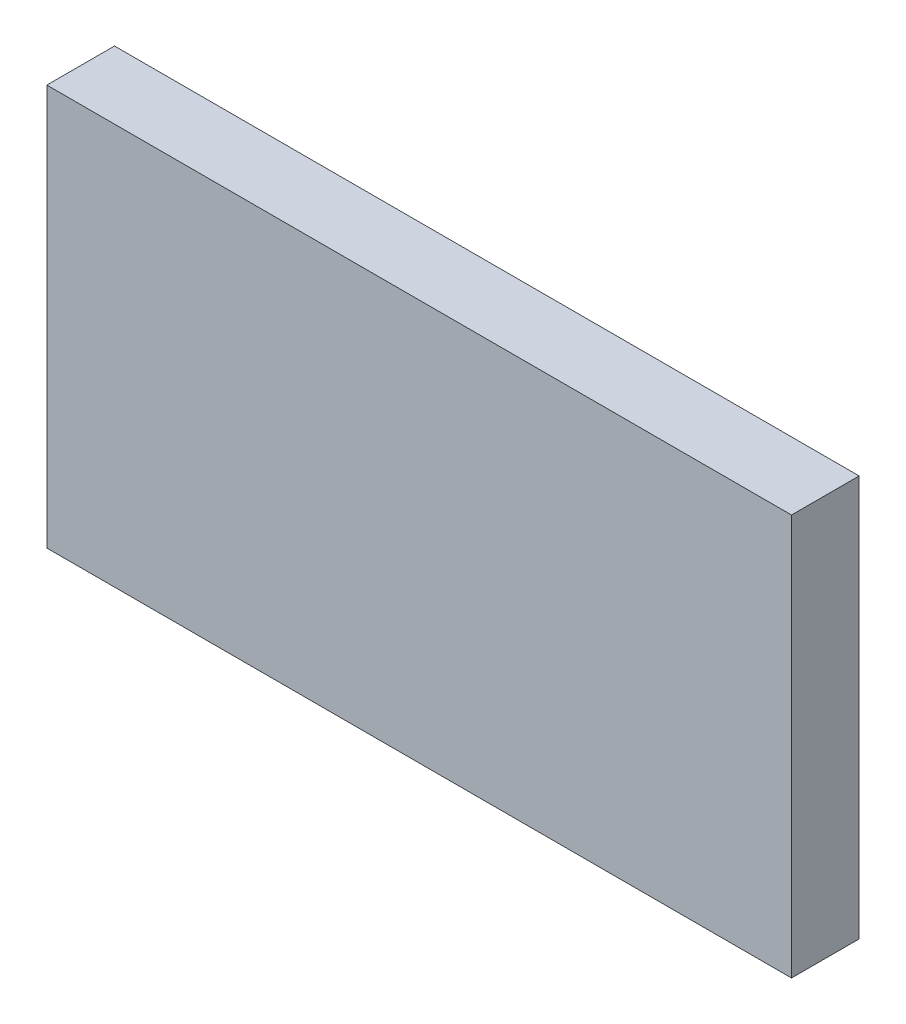
ISO-10303-21;
HEADER;
FILE_DESCRIPTION(('STEP AP214'),'2;1');
FILE_NAME('part.step','',(''),(''),'','','');
FILE_SCHEMA(('AUTOMOTIVE_DESIGN { 1 0 10303 214 1 1 1 1 }'));
ENDSEC;
DATA;
#1=APPLICATION_CONTEXT('core data for automotive mechanical design processes');
#2=APPLICATION_PROTOCOL_DEFINITION('international standard','automotive_design',2000,#1);
#3=PRODUCT_CONTEXT('',#1,'mechanical');
#4=PRODUCT('Part','Part','',(#3));
#5=PRODUCT_RELATED_PRODUCT_CATEGORY('part','',(#4));
#6=PRODUCT_DEFINITION_FORMATION('','',#4);
#7=PRODUCT_DEFINITION_CONTEXT('part definition',#1,'design');
#8=PRODUCT_DEFINITION('design','',#6,#7);
#9=PRODUCT_DEFINITION_SHAPE('','',#8);
#10=(LENGTH_UNIT() NAMED_UNIT(*) SI_UNIT(.MILLI.,.METRE.));
#11=(NAMED_UNIT(*) PLANE_ANGLE_UNIT() SI_UNIT($,.RADIAN.));
#12=(NAMED_UNIT(*) SI_UNIT($,.STERADIAN.) SOLID_ANGLE_UNIT());
#13=UNCERTAINTY_MEASURE_WITH_UNIT(LENGTH_MEASURE(1.E-05),#10,'distance_accuracy_value','');
#14=(GEOMETRIC_REPRESENTATION_CONTEXT(3) GLOBAL_UNCERTAINTY_ASSIGNED_CONTEXT((#13)) GLOBAL_UNIT_ASSIGNED_CONTEXT((#10,
#11,#12)) REPRESENTATION_CONTEXT('',''));
#15=CARTESIAN_POINT('',(0.,0.,0.));
#16=DIRECTION('',(0.,0.,1.));
#17=DIRECTION('',(1.,0.,0.));
#18=AXIS2_PLACEMENT_3D('',#15,#16,#17);
#19=CARTESIAN_POINT('',(-33.02,17.78,3.));
#20=DIRECTION('',(1.,0.,0.));
#21=DIRECTION('',(0.,0.,-1.));
#22=AXIS2_PLACEMENT_3D('',#19,#20,#21);
#23=PLANE('',#22);
#24=DIRECTION('',(0.,-1.,0.));
#25=VECTOR('',#24,1.);
#26=CARTESIAN_POINT('',(-33.02,17.78,0.));
#27=LINE('',#26,#25);
#28=CARTESIAN_POINT('',(-33.02,17.78,0.));
#29=VERTEX_POINT('',#28);
#30=CARTESIAN_POINT('',(-33.02,0.,0.));
#31=VERTEX_POINT('',#30);
#32=EDGE_CURVE('E96',#29,#31,#27,.T.);
#33=ORIENTED_EDGE('',*,*,#32,.T.);
#34=DIRECTION('',(0.,0.,-1.));
#35=VECTOR('',#34,1.);
#36=CARTESIAN_POINT('',(-33.02,0.,3.));
#37=LINE('',#36,#35);
#38=CARTESIAN_POINT('',(-33.02,0.,3.));
#39=VERTEX_POINT('',#38);
#40=EDGE_CURVE('E11',#39,#31,#37,.T.);
#41=ORIENTED_EDGE('',*,*,#40,.F.);
#42=DIRECTION('',(0.,-1.,0.));
#43=VECTOR('',#42,1.);
#44=CARTESIAN_POINT('',(-33.02,17.78,3.));
#45=LINE('',#44,#43);
#46=CARTESIAN_POINT('',(-33.02,17.78,3.));
#47=VERTEX_POINT('',#46);
#48=EDGE_CURVE('E84',#47,#39,#45,.T.);
#49=ORIENTED_EDGE('',*,*,#48,.F.);
#50=DIRECTION('',(0.,0.,-1.));
#51=VECTOR('',#50,1.);
#52=CARTESIAN_POINT('',(-33.02,17.78,3.));
#53=LINE('',#52,#51);
#54=EDGE_CURVE('E92',#47,#29,#53,.T.);
#55=ORIENTED_EDGE('',*,*,#54,.T.);
#56=EDGE_LOOP('',(#33,#41,#49,#55));
#57=FACE_BOUND('',#56,.T.);
#58=ADVANCED_FACE('F33',(#57),#23,.F.);
#59=CARTESIAN_POINT('',(-33.02,0.,3.));
#60=DIRECTION('',(0.,1.,0.));
#61=DIRECTION('',(0.,0.,1.));
#62=AXIS2_PLACEMENT_3D('',#59,#60,#61);
#63=PLANE('',#62);
#64=DIRECTION('',(1.,0.,0.));
#65=VECTOR('',#64,1.);
#66=CARTESIAN_POINT('',(-33.02,0.,0.));
#67=LINE('',#66,#65);
#68=CARTESIAN_POINT('',(0.,0.,0.));
#69=VERTEX_POINT('',#68);
#70=EDGE_CURVE('E88',#31,#69,#67,.T.);
#71=ORIENTED_EDGE('',*,*,#70,.T.);
#72=DIRECTION('',(0.,0.,-1.));
#73=VECTOR('',#72,1.);
#74=CARTESIAN_POINT('',(0.,0.,3.));
#75=LINE('',#74,#73);
#76=CARTESIAN_POINT('',(0.,0.,3.));
#77=VERTEX_POINT('',#76);
#78=EDGE_CURVE('E41',#77,#69,#75,.T.);
#79=ORIENTED_EDGE('',*,*,#78,.F.);
#80=DIRECTION('',(1.,0.,0.));
#81=VECTOR('',#80,1.);
#82=CARTESIAN_POINT('',(-33.02,0.,3.));
#83=LINE('',#82,#81);
#84=EDGE_CURVE('E79',#39,#77,#83,.T.);
#85=ORIENTED_EDGE('',*,*,#84,.F.);
#86=ORIENTED_EDGE('',*,*,#40,.T.);
#87=EDGE_LOOP('',(#71,#79,#85,#86));
#88=FACE_BOUND('',#87,.T.);
#89=ADVANCED_FACE('F87',(#88),#63,.F.);
#90=CARTESIAN_POINT('',(0.,17.78,3.));
#91=DIRECTION('',(-1.,0.,0.));
#92=DIRECTION('',(0.,0.,1.));
#93=AXIS2_PLACEMENT_3D('',#90,#91,#92);
#94=PLANE('',#93);
#95=DIRECTION('',(0.,1.,0.));
#96=VECTOR('',#95,1.);
#97=CARTESIAN_POINT('',(0.,17.78,0.));
#98=LINE('',#97,#96);
#99=CARTESIAN_POINT('',(0.,17.78,0.));
#100=VERTEX_POINT('',#99);
#101=EDGE_CURVE('E66',#69,#100,#98,.T.);
#102=ORIENTED_EDGE('',*,*,#101,.T.);
#103=DIRECTION('',(0.,0.,-1.));
#104=VECTOR('',#103,1.);
#105=CARTESIAN_POINT('',(0.,17.78,3.));
#106=LINE('',#105,#104);
#107=CARTESIAN_POINT('',(0.,17.78,3.));
#108=VERTEX_POINT('',#107);
#109=EDGE_CURVE('E89',#108,#100,#106,.T.);
#110=ORIENTED_EDGE('',*,*,#109,.F.);
#111=DIRECTION('',(0.,1.,0.));
#112=VECTOR('',#111,1.);
#113=CARTESIAN_POINT('',(0.,17.78,3.));
#114=LINE('',#113,#112);
#115=EDGE_CURVE('E82',#77,#108,#114,.T.);
#116=ORIENTED_EDGE('',*,*,#115,.F.);
#117=ORIENTED_EDGE('',*,*,#78,.T.);
#118=EDGE_LOOP('',(#102,#110,#116,#117));
#119=FACE_BOUND('',#118,.T.);
#120=ADVANCED_FACE('F90',(#119),#94,.F.);
#121=CARTESIAN_POINT('',(-33.02,17.78,3.));
#122=DIRECTION('',(0.,-1.,0.));
#123=DIRECTION('',(0.,0.,-1.));
#124=AXIS2_PLACEMENT_3D('',#121,#122,#123);
#125=PLANE('',#124);
#126=DIRECTION('',(-1.,0.,0.));
#127=VECTOR('',#126,1.);
#128=CARTESIAN_POINT('',(-33.02,17.78,0.));
#129=LINE('',#128,#127);
#130=EDGE_CURVE('E72',#100,#29,#129,.T.);
#131=ORIENTED_EDGE('',*,*,#130,.T.);
#132=ORIENTED_EDGE('',*,*,#54,.F.);
#133=DIRECTION('',(-1.,0.,0.));
#134=VECTOR('',#133,1.);
#135=CARTESIAN_POINT('',(-33.02,17.78,3.));
#136=LINE('',#135,#134);
#137=EDGE_CURVE('E49',#108,#47,#136,.T.);
#138=ORIENTED_EDGE('',*,*,#137,.F.);
#139=ORIENTED_EDGE('',*,*,#109,.T.);
#140=EDGE_LOOP('',(#131,#132,#138,#139));
#141=FACE_BOUND('',#140,.T.);
#142=ADVANCED_FACE('F103',(#141),#125,.F.);
#143=CARTESIAN_POINT('',(0.,0.,3.));
#144=DIRECTION('',(0.,0.,1.));
#145=DIRECTION('',(1.,0.,0.));
#146=AXIS2_PLACEMENT_3D('',#143,#144,#145);
#147=PLANE('',#146);
#148=ORIENTED_EDGE('',*,*,#48,.T.);
#149=ORIENTED_EDGE('',*,*,#84,.T.);
#150=ORIENTED_EDGE('',*,*,#115,.T.);
#151=ORIENTED_EDGE('',*,*,#137,.T.);
#152=EDGE_LOOP('',(#148,#149,#150,#151));
#153=FACE_BOUND('',#152,.T.);
#154=ADVANCED_FACE('F80',(#153),#147,.T.);
#155=CARTESIAN_POINT('',(0.,0.,0.));
#156=DIRECTION('',(0.,0.,1.));
#157=DIRECTION('',(1.,0.,0.));
#158=AXIS2_PLACEMENT_3D('',#155,#156,#157);
#159=PLANE('',#158);
#160=ORIENTED_EDGE('',*,*,#32,.F.);
#161=ORIENTED_EDGE('',*,*,#130,.F.);
#162=ORIENTED_EDGE('',*,*,#101,.F.);
#163=ORIENTED_EDGE('',*,*,#70,.F.);
#164=EDGE_LOOP('',(#160,#161,#162,#163));
#165=FACE_BOUND('',#164,.T.);
#166=ADVANCED_FACE('F106',(#165),#159,.F.);
#167=CLOSED_SHELL('',(#58,#89,#120,#142,#154,#166));
#168=MANIFOLD_SOLID_BREP('B2',#167);
#169=ADVANCED_BREP_SHAPE_REPRESENTATION('',(#18,#168),#14);
#170=SHAPE_DEFINITION_REPRESENTATION(#9,#169);
ENDSEC;
END-ISO-10303-21;
